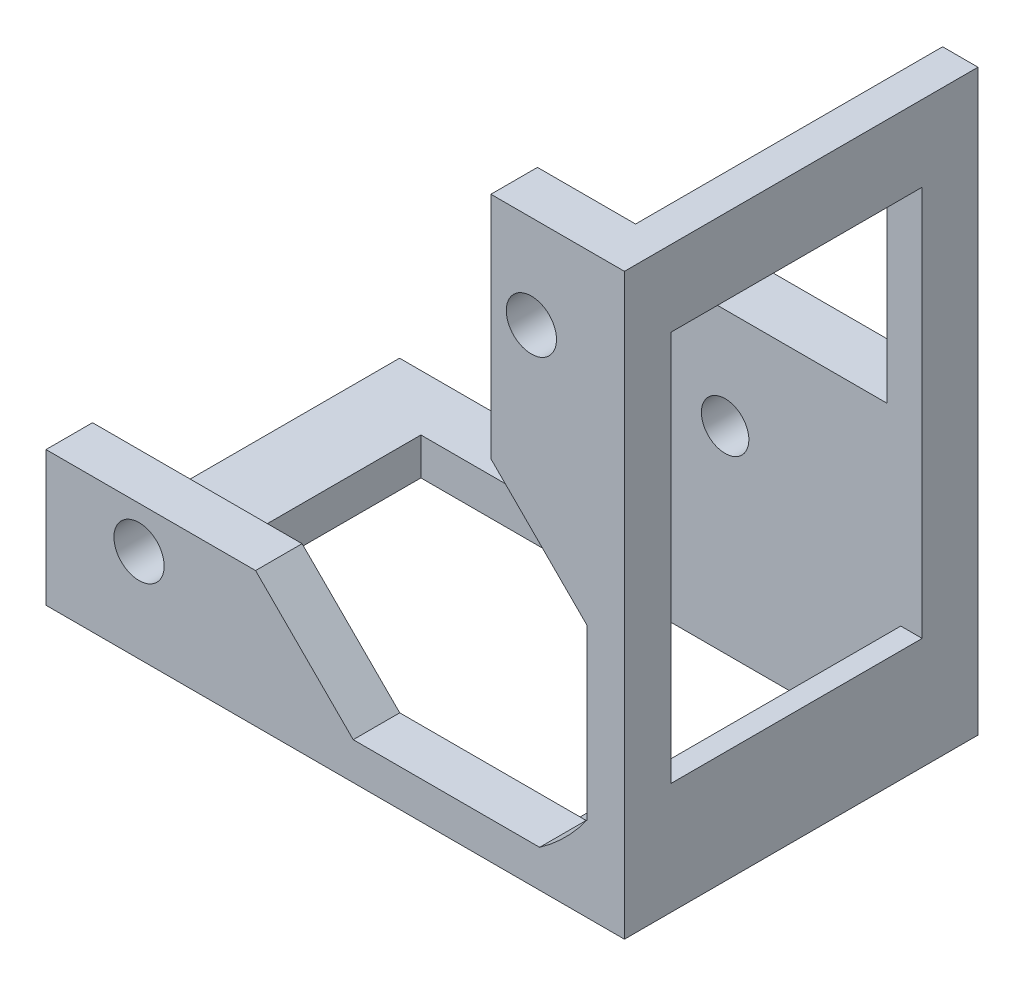
ISO-10303-21;
HEADER;
FILE_DESCRIPTION(('STEP AP214'),'2;1');
FILE_NAME('part.step','',(''),(''),'','','');
FILE_SCHEMA(('AUTOMOTIVE_DESIGN { 1 0 10303 214 1 1 1 1 }'));
ENDSEC;
DATA;
#1=APPLICATION_CONTEXT('core data for automotive mechanical design processes');
#2=APPLICATION_PROTOCOL_DEFINITION('international standard','automotive_design',2000,#1);
#3=PRODUCT_CONTEXT('',#1,'mechanical');
#4=PRODUCT('Part','Part','',(#3));
#5=PRODUCT_RELATED_PRODUCT_CATEGORY('part','',(#4));
#6=PRODUCT_DEFINITION_FORMATION('','',#4);
#7=PRODUCT_DEFINITION_CONTEXT('part definition',#1,'design');
#8=PRODUCT_DEFINITION('design','',#6,#7);
#9=PRODUCT_DEFINITION_SHAPE('','',#8);
#10=(LENGTH_UNIT() NAMED_UNIT(*) SI_UNIT(.MILLI.,.METRE.));
#11=(NAMED_UNIT(*) PLANE_ANGLE_UNIT() SI_UNIT($,.RADIAN.));
#12=(NAMED_UNIT(*) SI_UNIT($,.STERADIAN.) SOLID_ANGLE_UNIT());
#13=UNCERTAINTY_MEASURE_WITH_UNIT(LENGTH_MEASURE(1.E-05),#10,'distance_accuracy_value','');
#14=(GEOMETRIC_REPRESENTATION_CONTEXT(3) GLOBAL_UNCERTAINTY_ASSIGNED_CONTEXT((#13)) GLOBAL_UNIT_ASSIGNED_CONTEXT((#10,
#11,#12)) REPRESENTATION_CONTEXT('',''));
#15=CARTESIAN_POINT('',(0.,0.,0.));
#16=DIRECTION('',(0.,0.,1.));
#17=DIRECTION('',(1.,0.,0.));
#18=AXIS2_PLACEMENT_3D('',#15,#16,#17);
#19=CARTESIAN_POINT('',(117.830929329769,-164.974596583901,-421.));
#20=DIRECTION('',(0.,0.,-1.));
#21=DIRECTION('',(0.,1.,0.));
#22=AXIS2_PLACEMENT_3D('',#19,#20,#21);
#23=CYLINDRICAL_SURFACE('',#22,2.7);
#24=CARTESIAN_POINT('',(117.830929329769,-164.974596583901,-421.));
#25=DIRECTION('',(0.,0.,-1.));
#26=DIRECTION('',(0.,1.,0.));
#27=AXIS2_PLACEMENT_3D('',#24,#25,#26);
#28=CIRCLE('',#27,2.7);
#29=CARTESIAN_POINT('',(117.830929329769,-167.674596583901,-421.));
#30=VERTEX_POINT('',#29);
#31=EDGE_CURVE('E387',#30,#30,#28,.T.);
#32=ORIENTED_EDGE('',*,*,#31,.T.);
#33=DIRECTION('',(0.,0.,1.));
#34=VECTOR('',#33,1.);
#35=CARTESIAN_POINT('',(117.830929329769,-167.674596583901,-421.));
#36=LINE('',#35,#34);
#37=CARTESIAN_POINT('',(117.830929329769,-167.674596583901,-416.));
#38=VERTEX_POINT('',#37);
#39=EDGE_CURVE('E11',#30,#38,#36,.T.);
#40=ORIENTED_EDGE('',*,*,#39,.T.);
#41=CARTESIAN_POINT('',(117.830929329769,-164.974596583901,-416.));
#42=DIRECTION('',(0.,0.,1.));
#43=DIRECTION('',(0.,1.,0.));
#44=AXIS2_PLACEMENT_3D('',#41,#42,#43);
#45=CIRCLE('',#44,2.7);
#46=EDGE_CURVE('E343',#38,#38,#45,.T.);
#47=ORIENTED_EDGE('',*,*,#46,.T.);
#48=ORIENTED_EDGE('',*,*,#39,.F.);
#49=EDGE_LOOP('',(#32,#40,#47,#48));
#50=FACE_BOUND('',#49,.T.);
#51=ADVANCED_FACE('F16',(#50),#23,.F.);
#52=CARTESIAN_POINT('',(159.999969673495,-122.805556240176,-421.));
#53=DIRECTION('',(0.,0.,-1.));
#54=DIRECTION('',(0.,1.,0.));
#55=AXIS2_PLACEMENT_3D('',#52,#53,#54);
#56=CYLINDRICAL_SURFACE('',#55,2.7);
#57=CARTESIAN_POINT('',(159.999969673495,-122.805556240176,-421.));
#58=DIRECTION('',(0.,0.,-1.));
#59=DIRECTION('',(0.,1.,0.));
#60=AXIS2_PLACEMENT_3D('',#57,#58,#59);
#61=CIRCLE('',#60,2.7);
#62=CARTESIAN_POINT('',(159.999969673495,-125.505556240176,-421.));
#63=VERTEX_POINT('',#62);
#64=EDGE_CURVE('E451',#63,#63,#61,.T.);
#65=ORIENTED_EDGE('',*,*,#64,.T.);
#66=DIRECTION('',(0.,0.,1.));
#67=VECTOR('',#66,1.);
#68=CARTESIAN_POINT('',(159.999969673495,-125.505556240176,-421.));
#69=LINE('',#68,#67);
#70=CARTESIAN_POINT('',(159.999969673495,-125.505556240176,-416.));
#71=VERTEX_POINT('',#70);
#72=EDGE_CURVE('E27',#63,#71,#69,.T.);
#73=ORIENTED_EDGE('',*,*,#72,.T.);
#74=CARTESIAN_POINT('',(159.999969673495,-122.805556240176,-416.));
#75=DIRECTION('',(0.,0.,1.));
#76=DIRECTION('',(0.,1.,0.));
#77=AXIS2_PLACEMENT_3D('',#74,#75,#76);
#78=CIRCLE('',#77,2.7);
#79=EDGE_CURVE('E347',#71,#71,#78,.T.);
#80=ORIENTED_EDGE('',*,*,#79,.T.);
#81=ORIENTED_EDGE('',*,*,#72,.F.);
#82=EDGE_LOOP('',(#65,#73,#80,#81));
#83=FACE_BOUND('',#82,.T.);
#84=ADVANCED_FACE('F840',(#83),#56,.F.);
#85=CARTESIAN_POINT('',(143.062672238361,-138.974597314058,-421.));
#86=DIRECTION('',(0.,0.,1.));
#87=DIRECTION('',(1.,0.,0.));
#88=AXIS2_PLACEMENT_3D('',#85,#86,#87);
#89=PLANE('',#88);
#90=ORIENTED_EDGE('',*,*,#31,.F.);
#91=EDGE_LOOP('',(#90));
#92=FACE_BOUND('',#91,.T.);
#93=DIRECTION('',(1.,0.,0.));
#94=VECTOR('',#93,1.);
#95=CARTESIAN_POINT('',(135.711309430854,-160.478931824688,-421.));
#96=LINE('',#95,#94);
#97=CARTESIAN_POINT('',(107.830929329769,-160.478931824688,-421.));
#98=VERTEX_POINT('',#97);
#99=CARTESIAN_POINT('',(130.354281864133,-160.478931824688,-421.));
#100=VERTEX_POINT('',#99);
#101=EDGE_CURVE('E379',#98,#100,#96,.T.);
#102=ORIENTED_EDGE('',*,*,#101,.T.);
#103=DIRECTION('',(-0.707106781186547,0.707106781186548,0.));
#104=VECTOR('',#103,1.);
#105=CARTESIAN_POINT('',(130.280628209639,-160.405278170194,-421.));
#106=LINE('',#105,#104);
#107=CARTESIAN_POINT('',(140.849946623346,-170.974596583901,-421.));
#108=VERTEX_POINT('',#107);
#109=EDGE_CURVE('E359',#108,#100,#106,.T.);
#110=ORIENTED_EDGE('',*,*,#109,.F.);
#111=DIRECTION('',(1.,0.,0.));
#112=VECTOR('',#111,1.);
#113=CARTESIAN_POINT('',(107.830929329769,-170.974596583901,-421.));
#114=LINE('',#113,#112);
#115=CARTESIAN_POINT('',(160.88392236837,-170.974596583901,-421.));
#116=VERTEX_POINT('',#115);
#117=EDGE_CURVE('E334',#108,#116,#114,.T.);
#118=ORIENTED_EDGE('',*,*,#117,.T.);
#119=CARTESIAN_POINT('',(148.821478068075,-153.796104978481,-421.));
#120=DIRECTION('',(0.,0.,1.));
#121=DIRECTION('',(0.,1.,0.));
#122=AXIS2_PLACEMENT_3D('',#119,#120,#121);
#123=CIRCLE('',#122,20.9905487383057);
#124=CARTESIAN_POINT('',(159.125375443977,-172.083609871223,-421.000004917383));
#125=VERTEX_POINT('',#124);
#126=EDGE_CURVE('E314',#125,#116,#123,.T.);
#127=ORIENTED_EDGE('',*,*,#126,.F.);
#128=DIRECTION('',(0.,1.,0.));
#129=VECTOR('',#128,1.);
#130=CARTESIAN_POINT('',(159.125375443977,-174.974596583901,-421.000004917383));
#131=LINE('',#130,#129);
#132=CARTESIAN_POINT('',(159.125375443977,-174.974596583901,-421.000004917383));
#133=VERTEX_POINT('',#132);
#134=EDGE_CURVE('E404',#133,#125,#131,.T.);
#135=ORIENTED_EDGE('',*,*,#134,.F.);
#136=DIRECTION('',(1.,0.,0.));
#137=VECTOR('',#136,1.);
#138=CARTESIAN_POINT('',(116.125374803227,-174.974596583901,-421.000004917383));
#139=LINE('',#138,#137);
#140=CARTESIAN_POINT('',(116.125374803227,-174.974596583901,-421.000004917383));
#141=VERTEX_POINT('',#140);
#142=EDGE_CURVE('E416',#141,#133,#139,.T.);
#143=ORIENTED_EDGE('',*,*,#142,.F.);
#144=DIRECTION('',(0.,-1.,0.));
#145=VECTOR('',#144,1.);
#146=CARTESIAN_POINT('',(116.125374803227,-174.974596583901,-421.000004917383));
#147=LINE('',#146,#145);
#148=CARTESIAN_POINT('',(116.125374803227,-170.974596583901,-421.000004917383));
#149=VERTEX_POINT('',#148);
#150=EDGE_CURVE('E400',#149,#141,#147,.T.);
#151=ORIENTED_EDGE('',*,*,#150,.F.);
#152=DIRECTION('',(-1.,0.,0.));
#153=VECTOR('',#152,1.);
#154=CARTESIAN_POINT('',(125.446800784065,-170.974596583901,-421.));
#155=LINE('',#154,#153);
#156=CARTESIAN_POINT('',(107.830929329769,-170.974596583901,-421.));
#157=VERTEX_POINT('',#156);
#158=EDGE_CURVE('E370',#149,#157,#155,.T.);
#159=ORIENTED_EDGE('',*,*,#158,.T.);
#160=DIRECTION('',(0.,-1.,0.));
#161=VECTOR('',#160,1.);
#162=CARTESIAN_POINT('',(107.830929329769,-154.974596583901,-421.));
#163=LINE('',#162,#161);
#164=EDGE_CURVE('E136',#98,#157,#163,.T.);
#165=ORIENTED_EDGE('',*,*,#164,.F.);
#166=EDGE_LOOP('',(#102,#110,#118,#127,#135,#143,#151,#159,#165));
#167=FACE_BOUND('',#166,.T.);
#168=ADVANCED_FACE('F648',(#92,#167),#89,.F.);
#169=CARTESIAN_POINT('',(107.830929329769,-174.974596583901,-421.));
#170=DIRECTION('',(1.,0.,0.));
#171=DIRECTION('',(0.,1.,0.));
#172=AXIS2_PLACEMENT_3D('',#169,#170,#171);
#173=PLANE('',#172);
#174=ORIENTED_EDGE('',*,*,#164,.T.);
#175=DIRECTION('',(0.,0.,-1.));
#176=VECTOR('',#175,1.);
#177=CARTESIAN_POINT('',(107.830929329769,-170.974596583901,-421.));
#178=LINE('',#177,#176);
#179=CARTESIAN_POINT('',(107.830929329769,-170.974596583901,-454.));
#180=VERTEX_POINT('',#179);
#181=EDGE_CURVE('E374',#157,#180,#178,.T.);
#182=ORIENTED_EDGE('',*,*,#181,.T.);
#183=DIRECTION('',(0.,1.,0.));
#184=VECTOR('',#183,1.);
#185=CARTESIAN_POINT('',(107.830929329769,-174.974596583901,-454.));
#186=LINE('',#185,#184);
#187=CARTESIAN_POINT('',(107.830929329769,-174.974596583901,-454.));
#188=VERTEX_POINT('',#187);
#189=EDGE_CURVE('E393',#188,#180,#186,.T.);
#190=ORIENTED_EDGE('',*,*,#189,.F.);
#191=DIRECTION('',(0.,0.,1.));
#192=VECTOR('',#191,1.);
#193=CARTESIAN_POINT('',(107.830929329769,-174.974596583901,-418.5));
#194=LINE('',#193,#192);
#195=CARTESIAN_POINT('',(107.830929329769,-174.974596583901,-416.));
#196=VERTEX_POINT('',#195);
#197=EDGE_CURVE('E417',#188,#196,#194,.T.);
#198=ORIENTED_EDGE('',*,*,#197,.T.);
#199=DIRECTION('',(0.,1.,0.));
#200=VECTOR('',#199,1.);
#201=CARTESIAN_POINT('',(107.830929329769,-160.978931824688,-416.));
#202=LINE('',#201,#200);
#203=CARTESIAN_POINT('',(107.830929329769,-160.478931824688,-416.));
#204=VERTEX_POINT('',#203);
#205=EDGE_CURVE('E342',#196,#204,#202,.T.);
#206=ORIENTED_EDGE('',*,*,#205,.T.);
#207=DIRECTION('',(0.,0.,1.));
#208=VECTOR('',#207,1.);
#209=CARTESIAN_POINT('',(107.830929329769,-160.478931824688,-418.5));
#210=LINE('',#209,#208);
#211=EDGE_CURVE('E375',#98,#204,#210,.T.);
#212=ORIENTED_EDGE('',*,*,#211,.F.);
#213=EDGE_LOOP('',(#174,#182,#190,#198,#206,#212));
#214=FACE_BOUND('',#213,.T.);
#215=ADVANCED_FACE('F660',(#214),#173,.F.);
#216=CARTESIAN_POINT('',(165.999969673495,-132.934964665105,-416.));
#217=DIRECTION('',(1.,0.,0.));
#218=DIRECTION('',(0.,1.,0.));
#219=AXIS2_PLACEMENT_3D('',#216,#217,#218);
#220=PLANE('',#219);
#221=DIRECTION('',(0.,0.,1.));
#222=VECTOR('',#221,1.);
#223=CARTESIAN_POINT('',(165.999969673495,-147.784964665105,-416.));
#224=LINE('',#223,#222);
#225=CARTESIAN_POINT('',(165.999969673495,-147.784964665105,-421.));
#226=VERTEX_POINT('',#225);
#227=CARTESIAN_POINT('',(165.999969673495,-147.784964665105,-416.));
#228=VERTEX_POINT('',#227);
#229=EDGE_CURVE('E337',#226,#228,#224,.T.);
#230=ORIENTED_EDGE('',*,*,#229,.F.);
#231=DIRECTION('',(0.,1.,0.));
#232=VECTOR('',#231,1.);
#233=CARTESIAN_POINT('',(165.999969673495,-135.954780989581,-421.));
#234=LINE('',#233,#232);
#235=CARTESIAN_POINT('',(165.999969673495,-165.858549278776,-421.));
#236=VERTEX_POINT('',#235);
#237=EDGE_CURVE('E271',#236,#226,#234,.T.);
#238=ORIENTED_EDGE('',*,*,#237,.F.);
#239=DIRECTION('',(0.,0.,-1.));
#240=VECTOR('',#239,1.);
#241=CARTESIAN_POINT('',(165.999969673495,-165.858549278776,-454.));
#242=LINE('',#241,#240);
#243=CARTESIAN_POINT('',(165.999969673495,-165.858549278776,-416.));
#244=VERTEX_POINT('',#243);
#245=EDGE_CURVE('E264',#244,#236,#242,.T.);
#246=ORIENTED_EDGE('',*,*,#245,.F.);
#247=DIRECTION('',(0.,-1.,0.));
#248=VECTOR('',#247,1.);
#249=CARTESIAN_POINT('',(165.999969673495,-112.805556240176,-416.));
#250=LINE('',#249,#248);
#251=EDGE_CURVE('E268',#228,#244,#250,.T.);
#252=ORIENTED_EDGE('',*,*,#251,.F.);
#253=EDGE_LOOP('',(#230,#238,#246,#252));
#254=FACE_BOUND('',#253,.T.);
#255=ADVANCED_FACE('F266',(#254),#220,.F.);
#256=CARTESIAN_POINT('',(169.999969673495,-120.974598312436,-425.000004902482));
#257=DIRECTION('',(0.,1.,0.));
#258=DIRECTION('',(1.,0.,0.));
#259=AXIS2_PLACEMENT_3D('',#256,#257,#258);
#260=PLANE('',#259);
#261=DIRECTION('',(1.,0.,0.));
#262=VECTOR('',#261,1.);
#263=CARTESIAN_POINT('',(159.410723870785,-120.974598312436,-448.));
#264=LINE('',#263,#262);
#265=CARTESIAN_POINT('',(166.196900933288,-120.974598312436,-448.000005155802));
#266=VERTEX_POINT('',#265);
#267=CARTESIAN_POINT('',(169.999969673495,-120.974598312436,-448.000005155802));
#268=VERTEX_POINT('',#267);
#269=EDGE_CURVE('E466',#266,#268,#264,.T.);
#270=ORIENTED_EDGE('',*,*,#269,.T.);
#271=DIRECTION('',(0.,0.,-1.));
#272=VECTOR('',#271,1.);
#273=CARTESIAN_POINT('',(169.999969673495,-120.974598312436,-429.000002577901));
#274=LINE('',#273,#272);
#275=CARTESIAN_POINT('',(169.999969673495,-120.974598312436,-421.000004902482));
#276=VERTEX_POINT('',#275);
#277=EDGE_CURVE('E403',#276,#268,#274,.T.);
#278=ORIENTED_EDGE('',*,*,#277,.F.);
#279=DIRECTION('',(-1.,0.,0.));
#280=VECTOR('',#279,1.);
#281=CARTESIAN_POINT('',(169.999969673495,-120.974598312436,-421.000004902482));
#282=LINE('',#281,#280);
#283=CARTESIAN_POINT('',(166.196900933288,-120.974598312436,-421.000004902482));
#284=VERTEX_POINT('',#283);
#285=EDGE_CURVE('E420',#276,#284,#282,.T.);
#286=ORIENTED_EDGE('',*,*,#285,.T.);
#287=DIRECTION('',(0.,0.,1.));
#288=VECTOR('',#287,1.);
#289=CARTESIAN_POINT('',(166.196900933288,-120.974598312436,-431.500002577901));
#290=LINE('',#289,#288);
#291=EDGE_CURVE('E443',#266,#284,#290,.T.);
#292=ORIENTED_EDGE('',*,*,#291,.F.);
#293=EDGE_LOOP('',(#270,#278,#286,#292));
#294=FACE_BOUND('',#293,.T.);
#295=ADVANCED_FACE('F614',(#294),#260,.F.);
#296=CARTESIAN_POINT('',(107.830929329769,-170.974596583901,-421.));
#297=DIRECTION('',(0.,1.,0.));
#298=DIRECTION('',(1.,0.,0.));
#299=AXIS2_PLACEMENT_3D('',#296,#297,#298);
#300=PLANE('',#299);
#301=DIRECTION('',(0.,0.,-1.));
#302=VECTOR('',#301,1.);
#303=CARTESIAN_POINT('',(140.849946623346,-170.974596583901,-418.5));
#304=LINE('',#303,#302);
#305=CARTESIAN_POINT('',(140.849946623346,-170.974596583901,-416.));
#306=VERTEX_POINT('',#305);
#307=EDGE_CURVE('E324',#306,#108,#304,.T.);
#308=ORIENTED_EDGE('',*,*,#307,.F.);
#309=DIRECTION('',(1.,0.,0.));
#310=VECTOR('',#309,1.);
#311=CARTESIAN_POINT('',(107.830929329769,-170.974596583901,-416.));
#312=LINE('',#311,#310);
#313=CARTESIAN_POINT('',(160.88392236837,-170.974596583901,-416.));
#314=VERTEX_POINT('',#313);
#315=EDGE_CURVE('E289',#306,#314,#312,.T.);
#316=ORIENTED_EDGE('',*,*,#315,.T.);
#317=DIRECTION('',(0.,0.,1.));
#318=VECTOR('',#317,1.);
#319=CARTESIAN_POINT('',(160.88392236837,-170.974596583901,-454.));
#320=LINE('',#319,#318);
#321=EDGE_CURVE('E277',#116,#314,#320,.T.);
#322=ORIENTED_EDGE('',*,*,#321,.F.);
#323=ORIENTED_EDGE('',*,*,#117,.F.);
#324=EDGE_LOOP('',(#308,#316,#322,#323));
#325=FACE_BOUND('',#324,.T.);
#326=ADVANCED_FACE('F652',(#325),#300,.T.);
#327=CARTESIAN_POINT('',(158.574969673495,-140.359964665105,-416.));
#328=DIRECTION('',(-0.707106781186547,-0.707106781186548,0.));
#329=DIRECTION('',(-0.707106781186548,0.707106781186547,0.));
#330=AXIS2_PLACEMENT_3D('',#327,#328,#329);
#331=PLANE('',#330);
#332=DIRECTION('',(0.,0.,-1.));
#333=VECTOR('',#332,1.);
#334=CARTESIAN_POINT('',(155.648699836796,-137.433694828406,-418.5));
#335=LINE('',#334,#333);
#336=CARTESIAN_POINT('',(155.648699836796,-137.433694828406,-416.));
#337=VERTEX_POINT('',#336);
#338=CARTESIAN_POINT('',(155.648699836796,-137.433694828406,-421.));
#339=VERTEX_POINT('',#338);
#340=EDGE_CURVE('E455',#337,#339,#335,.T.);
#341=ORIENTED_EDGE('',*,*,#340,.T.);
#342=DIRECTION('',(0.707106781186548,-0.707106781186547,0.));
#343=VECTOR('',#342,1.);
#344=CARTESIAN_POINT('',(154.35055347695,-136.13554846856,-421.));
#345=LINE('',#344,#343);
#346=EDGE_CURVE('E350',#339,#226,#345,.T.);
#347=ORIENTED_EDGE('',*,*,#346,.T.);
#348=ORIENTED_EDGE('',*,*,#229,.T.);
#349=DIRECTION('',(-0.707106781186548,0.707106781186547,0.));
#350=VECTOR('',#349,1.);
#351=CARTESIAN_POINT('',(154.35055347695,-136.13554846856,-416.));
#352=LINE('',#351,#350);
#353=EDGE_CURVE('E20',#228,#337,#352,.T.);
#354=ORIENTED_EDGE('',*,*,#353,.T.);
#355=EDGE_LOOP('',(#341,#347,#348,#354));
#356=FACE_BOUND('',#355,.T.);
#357=ADVANCED_FACE('F817',(#356),#331,.T.);
#358=CARTESIAN_POINT('',(169.999969673495,-174.974596583901,-416.));
#359=DIRECTION('',(-1.,0.,0.));
#360=DIRECTION('',(0.,1.,0.));
#361=AXIS2_PLACEMENT_3D('',#358,#359,#360);
#362=PLANE('',#361);
#363=ORIENTED_EDGE('',*,*,#277,.T.);
#364=DIRECTION('',(0.,1.,0.));
#365=VECTOR('',#364,1.);
#366=CARTESIAN_POINT('',(169.999969673495,-147.974597448168,-448.000005155802));
#367=LINE('',#366,#365);
#368=CARTESIAN_POINT('',(169.999969673495,-162.974598938285,-448.000005155802));
#369=VERTEX_POINT('',#368);
#370=EDGE_CURVE('E384',#369,#268,#367,.T.);
#371=ORIENTED_EDGE('',*,*,#370,.F.);
#372=DIRECTION('',(0.,0.,1.));
#373=VECTOR('',#372,1.);
#374=CARTESIAN_POINT('',(169.999969673495,-162.974598938285,-429.000002577901));
#375=LINE('',#374,#373);
#376=CARTESIAN_POINT('',(169.999969673495,-162.974598938285,-421.000004902482));
#377=VERTEX_POINT('',#376);
#378=EDGE_CURVE('E276',#369,#377,#375,.T.);
#379=ORIENTED_EDGE('',*,*,#378,.T.);
#380=DIRECTION('',(0.,1.,0.));
#381=VECTOR('',#380,1.);
#382=CARTESIAN_POINT('',(169.999969673495,-168.974597761093,-421.000004902482));
#383=LINE('',#382,#381);
#384=EDGE_CURVE('E423',#377,#276,#383,.T.);
#385=ORIENTED_EDGE('',*,*,#384,.T.);
#386=EDGE_LOOP('',(#363,#371,#379,#385));
#387=FACE_BOUND('',#386,.T.);
#388=DIRECTION('',(0.,-1.,0.));
#389=VECTOR('',#388,1.);
#390=CARTESIAN_POINT('',(169.999969673495,-112.805556240176,-454.));
#391=LINE('',#390,#389);
#392=CARTESIAN_POINT('',(169.999969673495,-112.805556240176,-454.));
#393=VERTEX_POINT('',#392);
#394=CARTESIAN_POINT('',(169.999969673495,-174.974596583901,-454.));
#395=VERTEX_POINT('',#394);
#396=EDGE_CURVE('E500',#393,#395,#391,.T.);
#397=ORIENTED_EDGE('',*,*,#396,.F.);
#398=DIRECTION('',(0.,0.,-1.));
#399=VECTOR('',#398,1.);
#400=CARTESIAN_POINT('',(169.999969673495,-112.805556240176,-418.5));
#401=LINE('',#400,#399);
#402=CARTESIAN_POINT('',(169.999969673495,-112.805556240176,-416.));
#403=VERTEX_POINT('',#402);
#404=EDGE_CURVE('E311',#403,#393,#401,.T.);
#405=ORIENTED_EDGE('',*,*,#404,.F.);
#406=DIRECTION('',(0.,1.,0.));
#407=VECTOR('',#406,1.);
#408=CARTESIAN_POINT('',(169.999969673495,-174.974596583901,-416.));
#409=LINE('',#408,#407);
#410=CARTESIAN_POINT('',(169.999969673495,-174.974596583901,-416.));
#411=VERTEX_POINT('',#410);
#412=EDGE_CURVE('E481',#411,#403,#409,.T.);
#413=ORIENTED_EDGE('',*,*,#412,.F.);
#414=DIRECTION('',(0.,0.,-1.));
#415=VECTOR('',#414,1.);
#416=CARTESIAN_POINT('',(169.999969673495,-174.974596583901,-416.));
#417=LINE('',#416,#415);
#418=EDGE_CURVE('E373',#411,#395,#417,.T.);
#419=ORIENTED_EDGE('',*,*,#418,.T.);
#420=EDGE_LOOP('',(#397,#405,#413,#419));
#421=FACE_BOUND('',#420,.T.);
#422=ADVANCED_FACE('F593',(#387,#421),#362,.F.);
#423=CARTESIAN_POINT('',(116.125374803227,-174.974596583901,-443.000005170703));
#424=DIRECTION('',(-1.,0.,0.));
#425=DIRECTION('',(0.,1.,0.));
#426=AXIS2_PLACEMENT_3D('',#423,#424,#425);
#427=PLANE('',#426);
#428=DIRECTION('',(0.,1.,0.));
#429=VECTOR('',#428,1.);
#430=CARTESIAN_POINT('',(116.125374803227,-164.385350781191,-448.));
#431=LINE('',#430,#429);
#432=CARTESIAN_POINT('',(116.125374803227,-174.974596583901,-448.000005170703));
#433=VERTEX_POINT('',#432);
#434=CARTESIAN_POINT('',(116.125374803227,-170.974596583901,-448.000005170703));
#435=VERTEX_POINT('',#434);
#436=EDGE_CURVE('E330',#433,#435,#431,.T.);
#437=ORIENTED_EDGE('',*,*,#436,.T.);
#438=DIRECTION('',(0.,0.,-1.));
#439=VECTOR('',#438,1.);
#440=CARTESIAN_POINT('',(116.125374803227,-170.974596583901,-423.500002458692));
#441=LINE('',#440,#439);
#442=EDGE_CURVE('E315',#149,#435,#441,.T.);
#443=ORIENTED_EDGE('',*,*,#442,.F.);
#444=ORIENTED_EDGE('',*,*,#150,.T.);
#445=DIRECTION('',(0.,0.,1.));
#446=VECTOR('',#445,1.);
#447=CARTESIAN_POINT('',(116.125374803227,-174.974596583901,-421.000002458692));
#448=LINE('',#447,#446);
#449=EDGE_CURVE('E412',#433,#141,#448,.T.);
#450=ORIENTED_EDGE('',*,*,#449,.F.);
#451=EDGE_LOOP('',(#437,#443,#444,#450));
#452=FACE_BOUND('',#451,.T.);
#453=ADVANCED_FACE('F933',(#452),#427,.F.);
#454=CARTESIAN_POINT('',(159.125375443977,-174.974596583901,-426.000004917383));
#455=DIRECTION('',(1.,0.,0.));
#456=DIRECTION('',(0.,1.,0.));
#457=AXIS2_PLACEMENT_3D('',#454,#455,#456);
#458=PLANE('',#457);
#459=DIRECTION('',(0.,-1.,0.));
#460=VECTOR('',#459,1.);
#461=CARTESIAN_POINT('',(159.125375443977,-164.385350781191,-448.));
#462=LINE('',#461,#460);
#463=CARTESIAN_POINT('',(159.125375443977,-172.083609871223,-448.000005170703));
#464=VERTEX_POINT('',#463);
#465=CARTESIAN_POINT('',(159.125375443977,-174.974596583901,-448.000005170703));
#466=VERTEX_POINT('',#465);
#467=EDGE_CURVE('E326',#464,#466,#462,.T.);
#468=ORIENTED_EDGE('',*,*,#467,.T.);
#469=DIRECTION('',(0.,0.,-1.));
#470=VECTOR('',#469,1.);
#471=CARTESIAN_POINT('',(159.125375443977,-174.974596583901,-421.000002458692));
#472=LINE('',#471,#470);
#473=EDGE_CURVE('E447',#133,#466,#472,.T.);
#474=ORIENTED_EDGE('',*,*,#473,.F.);
#475=ORIENTED_EDGE('',*,*,#134,.T.);
#476=DIRECTION('',(0.,0.,1.));
#477=VECTOR('',#476,1.);
#478=CARTESIAN_POINT('',(159.125375443977,-172.083609871223,-454.));
#479=LINE('',#478,#477);
#480=EDGE_CURVE('E399',#464,#125,#479,.T.);
#481=ORIENTED_EDGE('',*,*,#480,.F.);
#482=EDGE_LOOP('',(#468,#474,#475,#481));
#483=FACE_BOUND('',#482,.T.);
#484=ADVANCED_FACE('F645',(#483),#458,.F.);
#485=CARTESIAN_POINT('',(169.999969673495,-162.974598938285,-442.000005155802));
#486=DIRECTION('',(0.,-1.,0.));
#487=DIRECTION('',(0.,0.,-1.));
#488=AXIS2_PLACEMENT_3D('',#485,#486,#487);
#489=PLANE('',#488);
#490=DIRECTION('',(-1.,0.,0.));
#491=VECTOR('',#490,1.);
#492=CARTESIAN_POINT('',(159.410723870785,-162.974598938285,-448.));
#493=LINE('',#492,#491);
#494=CARTESIAN_POINT('',(167.698935125768,-162.974598938285,-448.000005155802));
#495=VERTEX_POINT('',#494);
#496=EDGE_CURVE('E380',#369,#495,#493,.T.);
#497=ORIENTED_EDGE('',*,*,#496,.T.);
#498=DIRECTION('',(0.,0.,-1.));
#499=VECTOR('',#498,1.);
#500=CARTESIAN_POINT('',(167.698935125768,-162.974598938285,-454.));
#501=LINE('',#500,#499);
#502=CARTESIAN_POINT('',(167.698935125768,-162.974598938285,-421.000004902482));
#503=VERTEX_POINT('',#502);
#504=EDGE_CURVE('E509',#503,#495,#501,.T.);
#505=ORIENTED_EDGE('',*,*,#504,.F.);
#506=DIRECTION('',(1.,0.,0.));
#507=VECTOR('',#506,1.);
#508=CARTESIAN_POINT('',(169.999969673495,-162.974598938285,-421.000004902482));
#509=LINE('',#508,#507);
#510=EDGE_CURVE('E470',#503,#377,#509,.T.);
#511=ORIENTED_EDGE('',*,*,#510,.T.);
#512=ORIENTED_EDGE('',*,*,#378,.F.);
#513=EDGE_LOOP('',(#497,#505,#511,#512));
#514=FACE_BOUND('',#513,.T.);
#515=ADVANCED_FACE('F640',(#514),#489,.F.);
#516=CARTESIAN_POINT('',(148.821478068075,-153.796104978481,-454.));
#517=DIRECTION('',(0.,0.,1.));
#518=DIRECTION('',(0.,1.,0.));
#519=AXIS2_PLACEMENT_3D('',#516,#517,#518);
#520=CYLINDRICAL_SURFACE('',#519,20.9905487383057);
#521=ORIENTED_EDGE('',*,*,#504,.T.);
#522=CARTESIAN_POINT('',(148.821478068075,-153.796104978481,-448.));
#523=DIRECTION('',(0.,0.,-1.));
#524=DIRECTION('',(0.,1.,0.));
#525=AXIS2_PLACEMENT_3D('',#522,#523,#524);
#526=CIRCLE('',#525,20.9905487383057);
#527=EDGE_CURVE('E329',#495,#464,#526,.T.);
#528=ORIENTED_EDGE('',*,*,#527,.T.);
#529=ORIENTED_EDGE('',*,*,#480,.T.);
#530=ORIENTED_EDGE('',*,*,#126,.T.);
#531=ORIENTED_EDGE('',*,*,#321,.T.);
#532=CARTESIAN_POINT('',(148.821478068075,-153.796104978481,-416.));
#533=DIRECTION('',(0.,0.,-1.));
#534=DIRECTION('',(0.,1.,0.));
#535=AXIS2_PLACEMENT_3D('',#532,#533,#534);
#536=CIRCLE('',#535,20.9905487383057);
#537=EDGE_CURVE('E280',#244,#314,#536,.T.);
#538=ORIENTED_EDGE('',*,*,#537,.F.);
#539=ORIENTED_EDGE('',*,*,#245,.T.);
#540=CARTESIAN_POINT('',(148.821478068075,-153.796104978481,-421.));
#541=DIRECTION('',(0.,0.,1.));
#542=DIRECTION('',(0.,1.,0.));
#543=AXIS2_PLACEMENT_3D('',#540,#541,#542);
#544=CIRCLE('',#543,20.9905487383057);
#545=EDGE_CURVE('E351',#236,#503,#544,.T.);
#546=ORIENTED_EDGE('',*,*,#545,.T.);
#547=EDGE_LOOP('',(#521,#528,#529,#530,#531,#538,#539,#546));
#548=FACE_BOUND('',#547,.T.);
#549=ADVANCED_FACE('F282',(#548),#520,.F.);
#550=CARTESIAN_POINT('',(136.759033767781,-142.974101259783,-454.));
#551=DIRECTION('',(0.,-1.,0.));
#552=DIRECTION('',(0.,0.,-1.));
#553=AXIS2_PLACEMENT_3D('',#550,#551,#552);
#554=PLANE('',#553);
#555=DIRECTION('',(0.,0.,-1.));
#556=VECTOR('',#555,1.);
#557=CARTESIAN_POINT('',(143.197033767781,-142.974101259783,-454.));
#558=LINE('',#557,#556);
#559=CARTESIAN_POINT('',(143.197033767781,-142.974101259783,-448.));
#560=VERTEX_POINT('',#559);
#561=CARTESIAN_POINT('',(143.197033767781,-142.974101259783,-454.));
#562=VERTEX_POINT('',#561);
#563=EDGE_CURVE('E310',#560,#562,#558,.T.);
#564=ORIENTED_EDGE('',*,*,#563,.F.);
#565=DIRECTION('',(-1.,0.,0.));
#566=VECTOR('',#565,1.);
#567=CARTESIAN_POINT('',(142.790255917928,-142.974101259783,-448.));
#568=LINE('',#567,#566);
#569=CARTESIAN_POINT('',(166.196900933288,-142.974101259783,-448.));
#570=VERTEX_POINT('',#569);
#571=EDGE_CURVE('E508',#570,#560,#568,.T.);
#572=ORIENTED_EDGE('',*,*,#571,.F.);
#573=DIRECTION('',(0.,0.,1.));
#574=VECTOR('',#573,1.);
#575=CARTESIAN_POINT('',(166.196900933288,-142.974101259783,-421.));
#576=LINE('',#575,#574);
#577=CARTESIAN_POINT('',(166.196900933288,-142.974101259783,-454.));
#578=VERTEX_POINT('',#577);
#579=EDGE_CURVE('E430',#578,#570,#576,.T.);
#580=ORIENTED_EDGE('',*,*,#579,.F.);
#581=DIRECTION('',(1.,0.,0.));
#582=VECTOR('',#581,1.);
#583=CARTESIAN_POINT('',(142.790255917928,-142.974101259783,-454.));
#584=LINE('',#583,#582);
#585=EDGE_CURVE('E360',#562,#578,#584,.T.);
#586=ORIENTED_EDGE('',*,*,#585,.F.);
#587=EDGE_LOOP('',(#564,#572,#580,#586));
#588=FACE_BOUND('',#587,.T.);
#589=ADVANCED_FACE('F609',(#588),#554,.F.);
#590=CARTESIAN_POINT('',(138.197033767781,-170.974596583901,-454.));
#591=DIRECTION('',(1.,0.,0.));
#592=DIRECTION('',(0.,1.,0.));
#593=AXIS2_PLACEMENT_3D('',#590,#591,#592);
#594=PLANE('',#593);
#595=DIRECTION('',(0.,0.,1.));
#596=VECTOR('',#595,1.);
#597=CARTESIAN_POINT('',(138.197033767781,-147.974101259783,-454.));
#598=LINE('',#597,#596);
#599=CARTESIAN_POINT('',(138.197033767781,-147.974101259783,-454.));
#600=VERTEX_POINT('',#599);
#601=CARTESIAN_POINT('',(138.197033767781,-147.974101259783,-448.));
#602=VERTEX_POINT('',#601);
#603=EDGE_CURVE('E501',#600,#602,#598,.T.);
#604=ORIENTED_EDGE('',*,*,#603,.F.);
#605=DIRECTION('',(0.,1.,0.));
#606=VECTOR('',#605,1.);
#607=CARTESIAN_POINT('',(138.197033767781,-162.385350781191,-454.));
#608=LINE('',#607,#606);
#609=CARTESIAN_POINT('',(138.197033767781,-170.974596583901,-454.));
#610=VERTEX_POINT('',#609);
#611=EDGE_CURVE('E392',#610,#600,#608,.T.);
#612=ORIENTED_EDGE('',*,*,#611,.F.);
#613=DIRECTION('',(0.,0.,-1.));
#614=VECTOR('',#613,1.);
#615=CARTESIAN_POINT('',(138.197033767781,-170.974596583901,-449.));
#616=LINE('',#615,#614);
#617=CARTESIAN_POINT('',(138.197033767781,-170.974596583901,-448.));
#618=VERTEX_POINT('',#617);
#619=EDGE_CURVE('E436',#618,#610,#616,.T.);
#620=ORIENTED_EDGE('',*,*,#619,.F.);
#621=DIRECTION('',(0.,-1.,0.));
#622=VECTOR('',#621,1.);
#623=CARTESIAN_POINT('',(138.197033767781,-162.385350781191,-448.));
#624=LINE('',#623,#622);
#625=EDGE_CURVE('E124',#602,#618,#624,.T.);
#626=ORIENTED_EDGE('',*,*,#625,.F.);
#627=EDGE_LOOP('',(#604,#612,#620,#626));
#628=FACE_BOUND('',#627,.T.);
#629=ADVANCED_FACE('F808',(#628),#594,.F.);
#630=CARTESIAN_POINT('',(148.821478068075,-153.796104978481,-448.));
#631=DIRECTION('',(0.,0.,-1.));
#632=DIRECTION('',(0.,-1.,0.));
#633=AXIS2_PLACEMENT_3D('',#630,#631,#632);
#634=PLANE('',#633);
#635=CARTESIAN_POINT('',(148.821478068075,-153.796104978481,-448.));
#636=DIRECTION('',(0.,0.,-1.));
#637=DIRECTION('',(0.,-1.,0.));
#638=AXIS2_PLACEMENT_3D('',#635,#636,#637);
#639=CIRCLE('',#638,2.55);
#640=CARTESIAN_POINT('',(148.821478068075,-151.246104978481,-448.));
#641=VERTEX_POINT('',#640);
#642=EDGE_CURVE('E355',#641,#641,#639,.T.);
#643=ORIENTED_EDGE('',*,*,#642,.T.);
#644=EDGE_LOOP('',(#643));
#645=FACE_BOUND('',#644,.T.);
#646=DIRECTION('',(0.707106781186547,0.707106781186548,0.));
#647=VECTOR('',#646,1.);
#648=CARTESIAN_POINT('',(140.64764391318,-145.523491114384,-448.));
#649=LINE('',#648,#647);
#650=EDGE_CURVE('E306',#602,#560,#649,.T.);
#651=ORIENTED_EDGE('',*,*,#650,.F.);
#652=ORIENTED_EDGE('',*,*,#625,.T.);
#653=DIRECTION('',(-1.,0.,0.));
#654=VECTOR('',#653,1.);
#655=CARTESIAN_POINT('',(142.790255917928,-170.974596583901,-448.));
#656=LINE('',#655,#654);
#657=CARTESIAN_POINT('',(136.759033767781,-170.974596583901,-448.));
#658=VERTEX_POINT('',#657);
#659=EDGE_CURVE('E369',#618,#658,#656,.T.);
#660=ORIENTED_EDGE('',*,*,#659,.T.);
#661=DIRECTION('',(-1.,0.,0.));
#662=VECTOR('',#661,1.);
#663=CARTESIAN_POINT('',(133.478152386873,-170.974596583901,-448.000005170703));
#664=LINE('',#663,#662);
#665=EDGE_CURVE('E319',#658,#435,#664,.T.);
#666=ORIENTED_EDGE('',*,*,#665,.T.);
#667=ORIENTED_EDGE('',*,*,#436,.F.);
#668=DIRECTION('',(1.,0.,0.));
#669=VECTOR('',#668,1.);
#670=CARTESIAN_POINT('',(137.625375123602,-174.974596583901,-448.000005170703));
#671=LINE('',#670,#669);
#672=EDGE_CURVE('E325',#433,#466,#671,.T.);
#673=ORIENTED_EDGE('',*,*,#672,.T.);
#674=ORIENTED_EDGE('',*,*,#467,.F.);
#675=ORIENTED_EDGE('',*,*,#527,.F.);
#676=ORIENTED_EDGE('',*,*,#496,.F.);
#677=ORIENTED_EDGE('',*,*,#370,.T.);
#678=ORIENTED_EDGE('',*,*,#269,.F.);
#679=DIRECTION('',(0.,-1.,0.));
#680=VECTOR('',#679,1.);
#681=CARTESIAN_POINT('',(166.196900933288,-131.49684978611,-448.000005155802));
#682=LINE('',#681,#680);
#683=CARTESIAN_POINT('',(166.196900933288,-142.019101259783,-448.));
#684=VERTEX_POINT('',#683);
#685=EDGE_CURVE('E320',#266,#684,#682,.T.);
#686=ORIENTED_EDGE('',*,*,#685,.T.);
#687=DIRECTION('',(0.,-1.,0.));
#688=VECTOR('',#687,1.);
#689=CARTESIAN_POINT('',(166.196900933288,-147.907603119132,-448.));
#690=LINE('',#689,#688);
#691=EDGE_CURVE('E434',#684,#570,#690,.T.);
#692=ORIENTED_EDGE('',*,*,#691,.T.);
#693=ORIENTED_EDGE('',*,*,#571,.T.);
#694=EDGE_LOOP('',(#651,#652,#660,#666,#667,#673,#674,#675,#676,#677,#678,#686,#692,#693));
#695=FACE_BOUND('',#694,.T.);
#696=ADVANCED_FACE('F610',(#645,#695),#634,.F.);
#697=CARTESIAN_POINT('',(140.697033767781,-145.474101259783,-454.));
#698=DIRECTION('',(-0.707106781186548,0.707106781186547,0.));
#699=DIRECTION('',(0.,0.,1.));
#700=AXIS2_PLACEMENT_3D('',#697,#698,#699);
#701=PLANE('',#700);
#702=ORIENTED_EDGE('',*,*,#650,.T.);
#703=ORIENTED_EDGE('',*,*,#563,.T.);
#704=DIRECTION('',(-0.707106781186547,-0.707106781186548,0.));
#705=VECTOR('',#704,1.);
#706=CARTESIAN_POINT('',(140.64764391318,-145.523491114384,-454.));
#707=LINE('',#706,#705);
#708=EDGE_CURVE('E365',#562,#600,#707,.T.);
#709=ORIENTED_EDGE('',*,*,#708,.T.);
#710=ORIENTED_EDGE('',*,*,#603,.T.);
#711=EDGE_LOOP('',(#702,#703,#709,#710));
#712=FACE_BOUND('',#711,.T.);
#713=ADVANCED_FACE('F898',(#712),#701,.T.);
#714=CARTESIAN_POINT('',(169.999969673495,-112.805556240176,-421.));
#715=DIRECTION('',(0.,1.,0.));
#716=DIRECTION('',(1.,0.,0.));
#717=AXIS2_PLACEMENT_3D('',#714,#715,#716);
#718=PLANE('',#717);
#719=DIRECTION('',(0.,0.,1.));
#720=VECTOR('',#719,1.);
#721=CARTESIAN_POINT('',(155.648699836796,-112.805556240176,-418.5));
#722=LINE('',#721,#720);
#723=CARTESIAN_POINT('',(155.648699836796,-112.805556240176,-421.));
#724=VERTEX_POINT('',#723);
#725=CARTESIAN_POINT('',(155.648699836796,-112.805556240176,-416.));
#726=VERTEX_POINT('',#725);
#727=EDGE_CURVE('E458',#724,#726,#722,.T.);
#728=ORIENTED_EDGE('',*,*,#727,.T.);
#729=DIRECTION('',(1.,0.,0.));
#730=VECTOR('',#729,1.);
#731=CARTESIAN_POINT('',(156.531320955928,-112.805556240176,-416.));
#732=LINE('',#731,#730);
#733=EDGE_CURVE('E429',#726,#403,#732,.T.);
#734=ORIENTED_EDGE('',*,*,#733,.T.);
#735=ORIENTED_EDGE('',*,*,#404,.T.);
#736=DIRECTION('',(1.,0.,0.));
#737=VECTOR('',#736,1.);
#738=CARTESIAN_POINT('',(166.196900933288,-112.805556240176,-454.));
#739=LINE('',#738,#737);
#740=CARTESIAN_POINT('',(166.196900933288,-112.805556240176,-454.));
#741=VERTEX_POINT('',#740);
#742=EDGE_CURVE('E496',#741,#393,#739,.T.);
#743=ORIENTED_EDGE('',*,*,#742,.F.);
#744=DIRECTION('',(0.,0.,-1.));
#745=VECTOR('',#744,1.);
#746=CARTESIAN_POINT('',(166.196900933288,-112.805556240176,-421.));
#747=LINE('',#746,#745);
#748=CARTESIAN_POINT('',(166.196900933288,-112.805556240176,-421.));
#749=VERTEX_POINT('',#748);
#750=EDGE_CURVE('E435',#749,#741,#747,.T.);
#751=ORIENTED_EDGE('',*,*,#750,.F.);
#752=DIRECTION('',(-1.,0.,0.));
#753=VECTOR('',#752,1.);
#754=CARTESIAN_POINT('',(156.531320955928,-112.805556240176,-421.));
#755=LINE('',#754,#753);
#756=EDGE_CURVE('E424',#749,#724,#755,.T.);
#757=ORIENTED_EDGE('',*,*,#756,.T.);
#758=EDGE_LOOP('',(#728,#734,#735,#743,#751,#757));
#759=FACE_BOUND('',#758,.T.);
#760=ADVANCED_FACE('F587',(#759),#718,.T.);
#761=CARTESIAN_POINT('',(155.648699836796,-112.805556240176,-416.));
#762=DIRECTION('',(1.,0.,0.));
#763=DIRECTION('',(0.,1.,0.));
#764=AXIS2_PLACEMENT_3D('',#761,#762,#763);
#765=PLANE('',#764);
#766=DIRECTION('',(0.,1.,0.));
#767=VECTOR('',#766,1.);
#768=CARTESIAN_POINT('',(155.648699836796,-135.954780989581,-421.));
#769=LINE('',#768,#767);
#770=EDGE_CURVE('E378',#339,#724,#769,.T.);
#771=ORIENTED_EDGE('',*,*,#770,.F.);
#772=ORIENTED_EDGE('',*,*,#340,.F.);
#773=DIRECTION('',(0.,-1.,0.));
#774=VECTOR('',#773,1.);
#775=CARTESIAN_POINT('',(155.648699836796,-135.954780989581,-416.));
#776=LINE('',#775,#774);
#777=EDGE_CURVE('E301',#726,#337,#776,.T.);
#778=ORIENTED_EDGE('',*,*,#777,.F.);
#779=ORIENTED_EDGE('',*,*,#727,.F.);
#780=EDGE_LOOP('',(#771,#772,#778,#779));
#781=FACE_BOUND('',#780,.T.);
#782=ADVANCED_FACE('F623',(#781),#765,.F.);
#783=CARTESIAN_POINT('',(143.062672238361,-138.974597314058,-421.));
#784=DIRECTION('',(0.,0.,1.));
#785=DIRECTION('',(1.,0.,0.));
#786=AXIS2_PLACEMENT_3D('',#783,#784,#785);
#787=PLANE('',#786);
#788=ORIENTED_EDGE('',*,*,#64,.F.);
#789=EDGE_LOOP('',(#788));
#790=FACE_BOUND('',#789,.T.);
#791=ORIENTED_EDGE('',*,*,#770,.T.);
#792=ORIENTED_EDGE('',*,*,#756,.F.);
#793=DIRECTION('',(0.,-1.,0.));
#794=VECTOR('',#793,1.);
#795=CARTESIAN_POINT('',(166.196900933288,-140.496849286921,-421.));
#796=LINE('',#795,#794);
#797=EDGE_CURVE('E439',#749,#284,#796,.T.);
#798=ORIENTED_EDGE('',*,*,#797,.T.);
#799=ORIENTED_EDGE('',*,*,#285,.F.);
#800=ORIENTED_EDGE('',*,*,#384,.F.);
#801=ORIENTED_EDGE('',*,*,#510,.F.);
#802=ORIENTED_EDGE('',*,*,#545,.F.);
#803=ORIENTED_EDGE('',*,*,#237,.T.);
#804=ORIENTED_EDGE('',*,*,#346,.F.);
#805=EDGE_LOOP('',(#791,#792,#798,#799,#800,#801,#802,#803,#804));
#806=FACE_BOUND('',#805,.T.);
#807=ADVANCED_FACE('F618',(#790,#806),#787,.F.);
#808=CARTESIAN_POINT('',(128.359946623346,-160.478931824688,-416.));
#809=DIRECTION('',(0.,1.,0.));
#810=DIRECTION('',(1.,0.,0.));
#811=AXIS2_PLACEMENT_3D('',#808,#809,#810);
#812=PLANE('',#811);
#813=ORIENTED_EDGE('',*,*,#101,.F.);
#814=ORIENTED_EDGE('',*,*,#211,.T.);
#815=DIRECTION('',(1.,0.,0.));
#816=VECTOR('',#815,1.);
#817=CARTESIAN_POINT('',(135.711309430854,-160.478931824688,-416.));
#818=LINE('',#817,#816);
#819=CARTESIAN_POINT('',(130.354281864133,-160.478931824688,-416.));
#820=VERTEX_POINT('',#819);
#821=EDGE_CURVE('E338',#204,#820,#818,.T.);
#822=ORIENTED_EDGE('',*,*,#821,.T.);
#823=DIRECTION('',(0.,0.,1.));
#824=VECTOR('',#823,1.);
#825=CARTESIAN_POINT('',(130.354281864133,-160.478931824688,-417.25));
#826=LINE('',#825,#824);
#827=EDGE_CURVE('E321',#100,#820,#826,.T.);
#828=ORIENTED_EDGE('',*,*,#827,.F.);
#829=EDGE_LOOP('',(#813,#814,#822,#828));
#830=FACE_BOUND('',#829,.T.);
#831=ADVANCED_FACE('F659',(#830),#812,.T.);
#832=CARTESIAN_POINT('',(134.604946623346,-164.729596583901,-418.5));
#833=DIRECTION('',(0.707106781186548,0.707106781186547,0.));
#834=DIRECTION('',(0.,0.,-1.));
#835=AXIS2_PLACEMENT_3D('',#832,#833,#834);
#836=PLANE('',#835);
#837=ORIENTED_EDGE('',*,*,#827,.T.);
#838=DIRECTION('',(0.707106781186547,-0.707106781186548,0.));
#839=VECTOR('',#838,1.);
#840=CARTESIAN_POINT('',(130.280628209639,-160.405278170194,-416.));
#841=LINE('',#840,#839);
#842=EDGE_CURVE('E333',#820,#306,#841,.T.);
#843=ORIENTED_EDGE('',*,*,#842,.T.);
#844=ORIENTED_EDGE('',*,*,#307,.T.);
#845=ORIENTED_EDGE('',*,*,#109,.T.);
#846=EDGE_LOOP('',(#837,#843,#844,#845));
#847=FACE_BOUND('',#846,.T.);
#848=ADVANCED_FACE('F18',(#847),#836,.T.);
#849=CARTESIAN_POINT('',(116.125374803227,-174.974596583901,-416.));
#850=DIRECTION('',(0.,1.,0.));
#851=DIRECTION('',(1.,0.,0.));
#852=AXIS2_PLACEMENT_3D('',#849,#850,#851);
#853=PLANE('',#852);
#854=ORIENTED_EDGE('',*,*,#449,.T.);
#855=ORIENTED_EDGE('',*,*,#142,.T.);
#856=ORIENTED_EDGE('',*,*,#473,.T.);
#857=ORIENTED_EDGE('',*,*,#672,.F.);
#858=EDGE_LOOP('',(#854,#855,#856,#857));
#859=FACE_BOUND('',#858,.T.);
#860=DIRECTION('',(-1.,0.,0.));
#861=VECTOR('',#860,1.);
#862=CARTESIAN_POINT('',(166.196900933288,-174.974596583901,-454.));
#863=LINE('',#862,#861);
#864=EDGE_CURVE('E304',#395,#188,#863,.T.);
#865=ORIENTED_EDGE('',*,*,#864,.F.);
#866=ORIENTED_EDGE('',*,*,#418,.F.);
#867=DIRECTION('',(1.,0.,0.));
#868=VECTOR('',#867,1.);
#869=CARTESIAN_POINT('',(116.125374803227,-174.974596583901,-416.));
#870=LINE('',#869,#868);
#871=EDGE_CURVE('E485',#196,#411,#870,.T.);
#872=ORIENTED_EDGE('',*,*,#871,.F.);
#873=ORIENTED_EDGE('',*,*,#197,.F.);
#874=EDGE_LOOP('',(#865,#866,#872,#873));
#875=FACE_BOUND('',#874,.T.);
#876=ADVANCED_FACE('F663',(#859,#875),#853,.F.);
#877=CARTESIAN_POINT('',(107.830929329769,-170.974596583901,-421.));
#878=DIRECTION('',(0.,1.,0.));
#879=DIRECTION('',(1.,0.,0.));
#880=AXIS2_PLACEMENT_3D('',#877,#878,#879);
#881=PLANE('',#880);
#882=ORIENTED_EDGE('',*,*,#442,.T.);
#883=ORIENTED_EDGE('',*,*,#665,.F.);
#884=ORIENTED_EDGE('',*,*,#659,.F.);
#885=ORIENTED_EDGE('',*,*,#619,.T.);
#886=DIRECTION('',(1.,0.,0.));
#887=VECTOR('',#886,1.);
#888=CARTESIAN_POINT('',(142.790255917928,-170.974596583901,-454.));
#889=LINE('',#888,#887);
#890=EDGE_CURVE('E388',#180,#610,#889,.T.);
#891=ORIENTED_EDGE('',*,*,#890,.F.);
#892=ORIENTED_EDGE('',*,*,#181,.F.);
#893=ORIENTED_EDGE('',*,*,#158,.F.);
#894=EDGE_LOOP('',(#882,#883,#884,#885,#891,#892,#893));
#895=FACE_BOUND('',#894,.T.);
#896=ADVANCED_FACE('F881',(#895),#881,.T.);
#897=CARTESIAN_POINT('',(166.196900933288,-142.019101259783,-421.));
#898=DIRECTION('',(-1.,0.,0.));
#899=DIRECTION('',(0.,1.,0.));
#900=AXIS2_PLACEMENT_3D('',#897,#898,#899);
#901=PLANE('',#900);
#902=ORIENTED_EDGE('',*,*,#291,.T.);
#903=ORIENTED_EDGE('',*,*,#797,.F.);
#904=ORIENTED_EDGE('',*,*,#750,.T.);
#905=DIRECTION('',(0.,1.,0.));
#906=VECTOR('',#905,1.);
#907=CARTESIAN_POINT('',(166.196900933288,-170.974596583901,-454.));
#908=LINE('',#907,#906);
#909=EDGE_CURVE('E364',#578,#741,#908,.T.);
#910=ORIENTED_EDGE('',*,*,#909,.F.);
#911=ORIENTED_EDGE('',*,*,#579,.T.);
#912=ORIENTED_EDGE('',*,*,#691,.F.);
#913=ORIENTED_EDGE('',*,*,#685,.F.);
#914=EDGE_LOOP('',(#902,#903,#904,#910,#911,#912,#913));
#915=FACE_BOUND('',#914,.T.);
#916=ADVANCED_FACE('F602',(#915),#901,.T.);
#917=CARTESIAN_POINT('',(148.821478068075,-153.796104978481,-448.));
#918=DIRECTION('',(0.,0.,-1.));
#919=DIRECTION('',(0.,-1.,0.));
#920=AXIS2_PLACEMENT_3D('',#917,#918,#919);
#921=CYLINDRICAL_SURFACE('',#920,2.55);
#922=CARTESIAN_POINT('',(148.821478068075,-153.796104978481,-454.));
#923=DIRECTION('',(0.,0.,1.));
#924=DIRECTION('',(0.,-1.,0.));
#925=AXIS2_PLACEMENT_3D('',#922,#923,#924);
#926=CIRCLE('',#925,2.55);
#927=CARTESIAN_POINT('',(148.821478068075,-151.246104978481,-454.));
#928=VERTEX_POINT('',#927);
#929=EDGE_CURVE('E575',#928,#928,#926,.T.);
#930=ORIENTED_EDGE('',*,*,#929,.F.);
#931=DIRECTION('',(0.,0.,1.));
#932=VECTOR('',#931,1.);
#933=CARTESIAN_POINT('',(148.821478068075,-151.246104978481,-448.));
#934=LINE('',#933,#932);
#935=EDGE_CURVE('E346',#928,#641,#934,.T.);
#936=ORIENTED_EDGE('',*,*,#935,.T.);
#937=ORIENTED_EDGE('',*,*,#642,.F.);
#938=ORIENTED_EDGE('',*,*,#935,.F.);
#939=EDGE_LOOP('',(#930,#936,#937,#938));
#940=FACE_BOUND('',#939,.T.);
#941=ADVANCED_FACE('F910',(#940),#921,.F.);
#942=CARTESIAN_POINT('',(143.062672238361,-138.974597314058,-416.));
#943=DIRECTION('',(0.,0.,1.));
#944=DIRECTION('',(1.,0.,0.));
#945=AXIS2_PLACEMENT_3D('',#942,#943,#944);
#946=PLANE('',#945);
#947=ORIENTED_EDGE('',*,*,#46,.F.);
#948=EDGE_LOOP('',(#947));
#949=FACE_BOUND('',#948,.T.);
#950=ORIENTED_EDGE('',*,*,#79,.F.);
#951=EDGE_LOOP('',(#950));
#952=FACE_BOUND('',#951,.T.);
#953=ORIENTED_EDGE('',*,*,#871,.T.);
#954=ORIENTED_EDGE('',*,*,#412,.T.);
#955=ORIENTED_EDGE('',*,*,#733,.F.);
#956=ORIENTED_EDGE('',*,*,#777,.T.);
#957=ORIENTED_EDGE('',*,*,#353,.F.);
#958=ORIENTED_EDGE('',*,*,#251,.T.);
#959=ORIENTED_EDGE('',*,*,#537,.T.);
#960=ORIENTED_EDGE('',*,*,#315,.F.);
#961=ORIENTED_EDGE('',*,*,#842,.F.);
#962=ORIENTED_EDGE('',*,*,#821,.F.);
#963=ORIENTED_EDGE('',*,*,#205,.F.);
#964=EDGE_LOOP('',(#953,#954,#955,#956,#957,#958,#959,#960,#961,#962,#963));
#965=FACE_BOUND('',#964,.T.);
#966=ADVANCED_FACE('F292',(#949,#952,#965),#946,.T.);
#967=CARTESIAN_POINT('',(148.821478068075,-153.796104978481,-454.));
#968=DIRECTION('',(0.,0.,1.));
#969=DIRECTION('',(1.,0.,0.));
#970=AXIS2_PLACEMENT_3D('',#967,#968,#969);
#971=PLANE('',#970);
#972=ORIENTED_EDGE('',*,*,#929,.T.);
#973=EDGE_LOOP('',(#972));
#974=FACE_BOUND('',#973,.T.);
#975=ORIENTED_EDGE('',*,*,#864,.T.);
#976=ORIENTED_EDGE('',*,*,#189,.T.);
#977=ORIENTED_EDGE('',*,*,#890,.T.);
#978=ORIENTED_EDGE('',*,*,#611,.T.);
#979=ORIENTED_EDGE('',*,*,#708,.F.);
#980=ORIENTED_EDGE('',*,*,#585,.T.);
#981=ORIENTED_EDGE('',*,*,#909,.T.);
#982=ORIENTED_EDGE('',*,*,#742,.T.);
#983=ORIENTED_EDGE('',*,*,#396,.T.);
#984=EDGE_LOOP('',(#975,#976,#977,#978,#979,#980,#981,#982,#983));
#985=FACE_BOUND('',#984,.T.);
#986=ADVANCED_FACE('F598',(#974,#985),#971,.F.);
#987=CLOSED_SHELL('',(#51,#84,#168,#215,#255,#295,#326,#357,#422,#453,#484,#515,#549,#589,#629,
#696,#713,#760,#782,#807,#831,#848,#876,#896,#916,#941,#966,#986));
#988=MANIFOLD_SOLID_BREP('B1',#987);
#989=ADVANCED_BREP_SHAPE_REPRESENTATION('',(#18,#988),#14);
#990=SHAPE_DEFINITION_REPRESENTATION(#9,#989);
ENDSEC;
END-ISO-10303-21;
